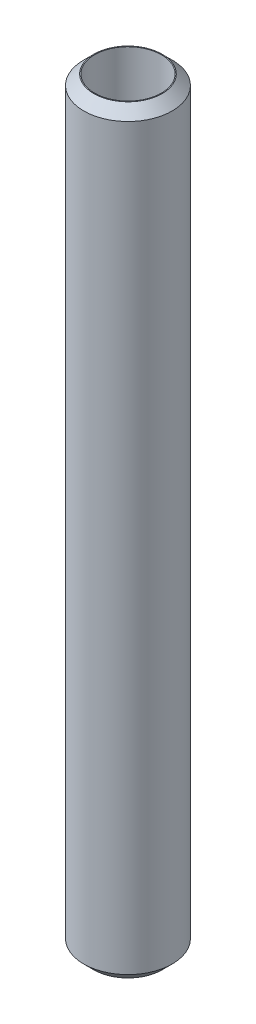
ISO-10303-21;
HEADER;
FILE_DESCRIPTION(('STEP AP214'),'2;1');
FILE_NAME('part.step','',(''),(''),'','','');
FILE_SCHEMA(('AUTOMOTIVE_DESIGN { 1 0 10303 214 1 1 1 1 }'));
ENDSEC;
DATA;
#1=APPLICATION_CONTEXT('core data for automotive mechanical design processes');
#2=APPLICATION_PROTOCOL_DEFINITION('international standard','automotive_design',2000,#1);
#3=PRODUCT_CONTEXT('',#1,'mechanical');
#4=PRODUCT('Part','Part','',(#3));
#5=PRODUCT_RELATED_PRODUCT_CATEGORY('part','',(#4));
#6=PRODUCT_DEFINITION_FORMATION('','',#4);
#7=PRODUCT_DEFINITION_CONTEXT('part definition',#1,'design');
#8=PRODUCT_DEFINITION('design','',#6,#7);
#9=PRODUCT_DEFINITION_SHAPE('','',#8);
#10=(LENGTH_UNIT() NAMED_UNIT(*) SI_UNIT(.MILLI.,.METRE.));
#11=(NAMED_UNIT(*) PLANE_ANGLE_UNIT() SI_UNIT($,.RADIAN.));
#12=(NAMED_UNIT(*) SI_UNIT($,.STERADIAN.) SOLID_ANGLE_UNIT());
#13=UNCERTAINTY_MEASURE_WITH_UNIT(LENGTH_MEASURE(1.E-05),#10,'distance_accuracy_value','');
#14=(GEOMETRIC_REPRESENTATION_CONTEXT(3) GLOBAL_UNCERTAINTY_ASSIGNED_CONTEXT((#13)) GLOBAL_UNIT_ASSIGNED_CONTEXT((#10,
#11,#12)) REPRESENTATION_CONTEXT('',''));
#15=CARTESIAN_POINT('',(0.,0.,0.));
#16=DIRECTION('',(0.,0.,1.));
#17=DIRECTION('',(1.,0.,0.));
#18=AXIS2_PLACEMENT_3D('',#15,#16,#17);
#19=CARTESIAN_POINT('',(0.,429.279112158587,0.));
#20=DIRECTION('',(0.,-1.,0.));
#21=DIRECTION('',(0.,0.,-1.));
#22=AXIS2_PLACEMENT_3D('',#19,#20,#21);
#23=CYLINDRICAL_SURFACE('',#22,25.);
#24=CARTESIAN_POINT('',(0.,423.624238721511,0.));
#25=DIRECTION('',(0.,1.,0.));
#26=DIRECTION('',(0.,0.,1.));
#27=AXIS2_PLACEMENT_3D('',#24,#25,#26);
#28=CIRCLE('',#27,25.);
#29=CARTESIAN_POINT('',(0.,423.624238721511,25.));
#30=VERTEX_POINT('',#29);
#31=EDGE_CURVE('E50',#30,#30,#28,.F.);
#32=ORIENTED_EDGE('',*,*,#31,.T.);
#33=EDGE_LOOP('',(#32));
#34=FACE_BOUND('',#33,.T.);
#35=CARTESIAN_POINT('',(0.,5.65487343707527,0.));
#36=DIRECTION('',(0.,1.,0.));
#37=DIRECTION('',(0.,0.,1.));
#38=AXIS2_PLACEMENT_3D('',#35,#36,#37);
#39=CIRCLE('',#38,25.);
#40=CARTESIAN_POINT('',(0.,5.65487343707527,25.));
#41=VERTEX_POINT('',#40);
#42=EDGE_CURVE('E51',#41,#41,#39,.T.);
#43=ORIENTED_EDGE('',*,*,#42,.T.);
#44=EDGE_LOOP('',(#43));
#45=FACE_BOUND('',#44,.T.);
#46=ADVANCED_FACE('F39',(#34,#45),#23,.T.);
#47=CARTESIAN_POINT('',(0.,429.279112158587,0.));
#48=DIRECTION('',(0.,1.,0.));
#49=DIRECTION('',(0.,0.,1.));
#50=AXIS2_PLACEMENT_3D('',#47,#48,#49);
#51=PLANE('',#50);
#52=CARTESIAN_POINT('',(0.,429.279112158587,0.));
#53=DIRECTION('',(0.,1.,0.));
#54=DIRECTION('',(0.,0.,1.));
#55=AXIS2_PLACEMENT_3D('',#52,#53,#54);
#56=CIRCLE('',#55,19.3451265629245);
#57=CARTESIAN_POINT('',(0.,429.279112158587,19.3451265629245));
#58=VERTEX_POINT('',#57);
#59=EDGE_CURVE('E54',#58,#58,#56,.T.);
#60=ORIENTED_EDGE('',*,*,#59,.T.);
#61=EDGE_LOOP('',(#60));
#62=FACE_BOUND('',#61,.T.);
#63=CARTESIAN_POINT('',(0.,429.279112158587,0.));
#64=DIRECTION('',(0.,1.,0.));
#65=DIRECTION('',(0.,0.,1.));
#66=AXIS2_PLACEMENT_3D('',#63,#64,#65);
#67=CIRCLE('',#66,18.8569353185989);
#68=CARTESIAN_POINT('',(0.,429.279112158587,18.8569353185989));
#69=VERTEX_POINT('',#68);
#70=EDGE_CURVE('E58',#69,#69,#67,.T.);
#71=ORIENTED_EDGE('',*,*,#70,.F.);
#72=EDGE_LOOP('',(#71));
#73=FACE_BOUND('',#72,.T.);
#74=ADVANCED_FACE('F69',(#62,#73),#51,.T.);
#75=CARTESIAN_POINT('',(0.,0.,0.));
#76=DIRECTION('',(0.,1.,0.));
#77=DIRECTION('',(0.,0.,1.));
#78=AXIS2_PLACEMENT_3D('',#75,#76,#77);
#79=PLANE('',#78);
#80=CARTESIAN_POINT('',(0.,0.,0.));
#81=DIRECTION('',(0.,1.,0.));
#82=DIRECTION('',(0.,0.,1.));
#83=AXIS2_PLACEMENT_3D('',#80,#81,#82);
#84=CIRCLE('',#83,19.3451265629247);
#85=CARTESIAN_POINT('',(0.,0.,19.3451265629247));
#86=VERTEX_POINT('',#85);
#87=EDGE_CURVE('E10',#86,#86,#84,.F.);
#88=ORIENTED_EDGE('',*,*,#87,.T.);
#89=EDGE_LOOP('',(#88));
#90=FACE_BOUND('',#89,.T.);
#91=CARTESIAN_POINT('',(0.,0.,0.));
#92=DIRECTION('',(0.,1.,0.));
#93=DIRECTION('',(0.,0.,1.));
#94=AXIS2_PLACEMENT_3D('',#91,#92,#93);
#95=CIRCLE('',#94,18.8569353185989);
#96=CARTESIAN_POINT('',(0.,0.,18.8569353185989));
#97=VERTEX_POINT('',#96);
#98=EDGE_CURVE('E63',#97,#97,#95,.T.);
#99=ORIENTED_EDGE('',*,*,#98,.T.);
#100=EDGE_LOOP('',(#99));
#101=FACE_BOUND('',#100,.T.);
#102=ADVANCED_FACE('F75',(#90,#101),#79,.F.);
#103=CARTESIAN_POINT('',(0.,429.279112158587,0.));
#104=DIRECTION('',(0.,-1.,0.));
#105=DIRECTION('',(0.,0.,-1.));
#106=AXIS2_PLACEMENT_3D('',#103,#104,#105);
#107=CYLINDRICAL_SURFACE('',#106,18.8569353185989);
#108=ORIENTED_EDGE('',*,*,#70,.T.);
#109=EDGE_LOOP('',(#108));
#110=FACE_BOUND('',#109,.T.);
#111=ORIENTED_EDGE('',*,*,#98,.F.);
#112=EDGE_LOOP('',(#111));
#113=FACE_BOUND('',#112,.T.);
#114=ADVANCED_FACE('F70',(#110,#113),#107,.F.);
#115=CARTESIAN_POINT('',(0.,429.279112158587,0.));
#116=DIRECTION('',(0.,-1.,0.));
#117=DIRECTION('',(0.,0.,-1.));
#118=AXIS2_PLACEMENT_3D('',#115,#116,#117);
#119=CONICAL_SURFACE('',#118,19.3451265629245,0.785398163397446);
#120=ORIENTED_EDGE('',*,*,#31,.F.);
#121=EDGE_LOOP('',(#120));
#122=FACE_BOUND('',#121,.T.);
#123=ORIENTED_EDGE('',*,*,#59,.F.);
#124=EDGE_LOOP('',(#123));
#125=FACE_BOUND('',#124,.T.);
#126=ADVANCED_FACE('F81',(#122,#125),#119,.T.);
#127=CARTESIAN_POINT('',(0.,5.65487343707527,0.));
#128=DIRECTION('',(0.,1.,0.));
#129=DIRECTION('',(0.,0.,1.));
#130=AXIS2_PLACEMENT_3D('',#127,#128,#129);
#131=CONICAL_SURFACE('',#130,25.,0.785398163397451);
#132=ORIENTED_EDGE('',*,*,#87,.F.);
#133=EDGE_LOOP('',(#132));
#134=FACE_BOUND('',#133,.T.);
#135=ORIENTED_EDGE('',*,*,#42,.F.);
#136=EDGE_LOOP('',(#135));
#137=FACE_BOUND('',#136,.T.);
#138=ADVANCED_FACE('F45',(#134,#137),#131,.T.);
#139=CLOSED_SHELL('',(#46,#74,#102,#114,#126,#138));
#140=MANIFOLD_SOLID_BREP('B2',#139);
#141=ADVANCED_BREP_SHAPE_REPRESENTATION('',(#18,#140),#14);
#142=SHAPE_DEFINITION_REPRESENTATION(#9,#141);
ENDSEC;
END-ISO-10303-21;
